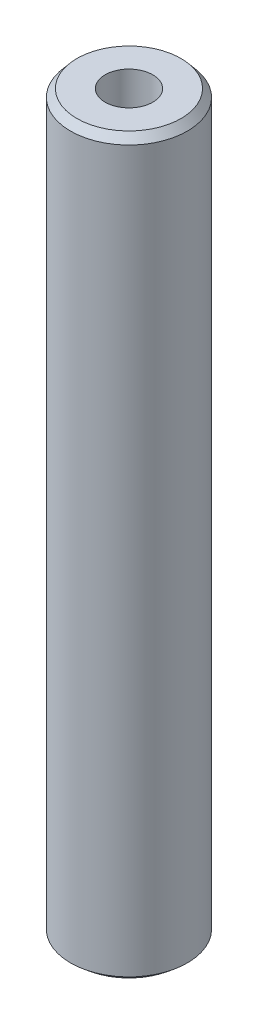
ISO-10303-21;
HEADER;
FILE_DESCRIPTION(('STEP AP214'),'2;1');
FILE_NAME('part.step','',(''),(''),'','','');
FILE_SCHEMA(('AUTOMOTIVE_DESIGN { 1 0 10303 214 1 1 1 1 }'));
ENDSEC;
DATA;
#1=APPLICATION_CONTEXT('core data for automotive mechanical design processes');
#2=APPLICATION_PROTOCOL_DEFINITION('international standard','automotive_design',2000,#1);
#3=PRODUCT_CONTEXT('',#1,'mechanical');
#4=PRODUCT('Part','Part','',(#3));
#5=PRODUCT_RELATED_PRODUCT_CATEGORY('part','',(#4));
#6=PRODUCT_DEFINITION_FORMATION('','',#4);
#7=PRODUCT_DEFINITION_CONTEXT('part definition',#1,'design');
#8=PRODUCT_DEFINITION('design','',#6,#7);
#9=PRODUCT_DEFINITION_SHAPE('','',#8);
#10=(LENGTH_UNIT() NAMED_UNIT(*) SI_UNIT(.MILLI.,.METRE.));
#11=(NAMED_UNIT(*) PLANE_ANGLE_UNIT() SI_UNIT($,.RADIAN.));
#12=(NAMED_UNIT(*) SI_UNIT($,.STERADIAN.) SOLID_ANGLE_UNIT());
#13=UNCERTAINTY_MEASURE_WITH_UNIT(LENGTH_MEASURE(1.E-05),#10,'distance_accuracy_value','');
#14=(GEOMETRIC_REPRESENTATION_CONTEXT(3) GLOBAL_UNCERTAINTY_ASSIGNED_CONTEXT((#13)) GLOBAL_UNIT_ASSIGNED_CONTEXT((#10,
#11,#12)) REPRESENTATION_CONTEXT('',''));
#15=CARTESIAN_POINT('',(0.,0.,0.));
#16=DIRECTION('',(0.,0.,1.));
#17=DIRECTION('',(1.,0.,0.));
#18=AXIS2_PLACEMENT_3D('',#15,#16,#17);
#19=CARTESIAN_POINT('',(0.,565.540317169403,0.));
#20=DIRECTION('',(0.,-1.,0.));
#21=DIRECTION('',(0.,0.,-1.));
#22=AXIS2_PLACEMENT_3D('',#19,#20,#21);
#23=CYLINDRICAL_SURFACE('',#22,45.);
#24=CARTESIAN_POINT('',(0.,559.626056848214,0.));
#25=DIRECTION('',(0.,1.,0.));
#26=DIRECTION('',(0.,0.,1.));
#27=AXIS2_PLACEMENT_3D('',#24,#25,#26);
#28=CIRCLE('',#27,45.);
#29=CARTESIAN_POINT('',(0.,559.626056848214,45.));
#30=VERTEX_POINT('',#29);
#31=EDGE_CURVE('E50',#30,#30,#28,.F.);
#32=ORIENTED_EDGE('',*,*,#31,.T.);
#33=EDGE_LOOP('',(#32));
#34=FACE_BOUND('',#33,.T.);
#35=CARTESIAN_POINT('',(0.,4.92343527548356,0.));
#36=DIRECTION('',(0.,1.,0.));
#37=DIRECTION('',(0.,0.,1.));
#38=AXIS2_PLACEMENT_3D('',#35,#36,#37);
#39=CIRCLE('',#38,45.);
#40=CARTESIAN_POINT('',(0.,4.92343527548356,45.));
#41=VERTEX_POINT('',#40);
#42=EDGE_CURVE('E51',#41,#41,#39,.T.);
#43=ORIENTED_EDGE('',*,*,#42,.T.);
#44=EDGE_LOOP('',(#43));
#45=FACE_BOUND('',#44,.T.);
#46=ADVANCED_FACE('F39',(#34,#45),#23,.T.);
#47=CARTESIAN_POINT('',(0.,565.540317169403,0.));
#48=DIRECTION('',(0.,1.,0.));
#49=DIRECTION('',(0.,0.,1.));
#50=AXIS2_PLACEMENT_3D('',#47,#48,#49);
#51=PLANE('',#50);
#52=CARTESIAN_POINT('',(0.,565.540317169403,0.));
#53=DIRECTION('',(0.,1.,0.));
#54=DIRECTION('',(0.,0.,1.));
#55=AXIS2_PLACEMENT_3D('',#52,#53,#54);
#56=CIRCLE('',#55,40.0765647245165);
#57=CARTESIAN_POINT('',(0.,565.540317169403,40.0765647245165));
#58=VERTEX_POINT('',#57);
#59=EDGE_CURVE('E54',#58,#58,#56,.T.);
#60=ORIENTED_EDGE('',*,*,#59,.T.);
#61=EDGE_LOOP('',(#60));
#62=FACE_BOUND('',#61,.T.);
#63=CARTESIAN_POINT('',(0.,565.540317169403,0.));
#64=DIRECTION('',(0.,1.,0.));
#65=DIRECTION('',(0.,0.,1.));
#66=AXIS2_PLACEMENT_3D('',#63,#64,#65);
#67=CIRCLE('',#66,18.3299555252651);
#68=CARTESIAN_POINT('',(0.,565.540317169403,18.3299555252651));
#69=VERTEX_POINT('',#68);
#70=EDGE_CURVE('E58',#69,#69,#67,.T.);
#71=ORIENTED_EDGE('',*,*,#70,.F.);
#72=EDGE_LOOP('',(#71));
#73=FACE_BOUND('',#72,.T.);
#74=ADVANCED_FACE('F69',(#62,#73),#51,.T.);
#75=CARTESIAN_POINT('',(0.,0.,0.));
#76=DIRECTION('',(0.,1.,0.));
#77=DIRECTION('',(0.,0.,1.));
#78=AXIS2_PLACEMENT_3D('',#75,#76,#77);
#79=PLANE('',#78);
#80=CARTESIAN_POINT('',(0.,0.,0.));
#81=DIRECTION('',(0.,1.,0.));
#82=DIRECTION('',(0.,0.,1.));
#83=AXIS2_PLACEMENT_3D('',#80,#81,#82);
#84=CIRCLE('',#83,39.0857396788108);
#85=CARTESIAN_POINT('',(0.,0.,39.0857396788108));
#86=VERTEX_POINT('',#85);
#87=EDGE_CURVE('E10',#86,#86,#84,.F.);
#88=ORIENTED_EDGE('',*,*,#87,.T.);
#89=EDGE_LOOP('',(#88));
#90=FACE_BOUND('',#89,.T.);
#91=CARTESIAN_POINT('',(0.,0.,0.));
#92=DIRECTION('',(0.,1.,0.));
#93=DIRECTION('',(0.,0.,1.));
#94=AXIS2_PLACEMENT_3D('',#91,#92,#93);
#95=CIRCLE('',#94,18.3299555252651);
#96=CARTESIAN_POINT('',(0.,0.,18.3299555252651));
#97=VERTEX_POINT('',#96);
#98=EDGE_CURVE('E63',#97,#97,#95,.T.);
#99=ORIENTED_EDGE('',*,*,#98,.T.);
#100=EDGE_LOOP('',(#99));
#101=FACE_BOUND('',#100,.T.);
#102=ADVANCED_FACE('F75',(#90,#101),#79,.F.);
#103=CARTESIAN_POINT('',(0.,565.540317169403,0.));
#104=DIRECTION('',(0.,-1.,0.));
#105=DIRECTION('',(0.,0.,-1.));
#106=AXIS2_PLACEMENT_3D('',#103,#104,#105);
#107=CYLINDRICAL_SURFACE('',#106,18.3299555252651);
#108=ORIENTED_EDGE('',*,*,#70,.T.);
#109=EDGE_LOOP('',(#108));
#110=FACE_BOUND('',#109,.T.);
#111=ORIENTED_EDGE('',*,*,#98,.F.);
#112=EDGE_LOOP('',(#111));
#113=FACE_BOUND('',#112,.T.);
#114=ADVANCED_FACE('F70',(#110,#113),#107,.F.);
#115=CARTESIAN_POINT('',(0.,565.540317169403,0.));
#116=DIRECTION('',(0.,-1.,0.));
#117=DIRECTION('',(0.,0.,-1.));
#118=AXIS2_PLACEMENT_3D('',#115,#116,#117);
#119=CONICAL_SURFACE('',#118,40.0765647245165,0.694227651369237);
#120=ORIENTED_EDGE('',*,*,#31,.F.);
#121=EDGE_LOOP('',(#120));
#122=FACE_BOUND('',#121,.T.);
#123=ORIENTED_EDGE('',*,*,#59,.F.);
#124=EDGE_LOOP('',(#123));
#125=FACE_BOUND('',#124,.T.);
#126=ADVANCED_FACE('F81',(#122,#125),#119,.T.);
#127=CARTESIAN_POINT('',(0.,4.92343527548356,0.));
#128=DIRECTION('',(0.,1.,0.));
#129=DIRECTION('',(0.,0.,1.));
#130=AXIS2_PLACEMENT_3D('',#127,#128,#129);
#131=CONICAL_SURFACE('',#130,45.,0.876568675425666);
#132=ORIENTED_EDGE('',*,*,#87,.F.);
#133=EDGE_LOOP('',(#132));
#134=FACE_BOUND('',#133,.T.);
#135=ORIENTED_EDGE('',*,*,#42,.F.);
#136=EDGE_LOOP('',(#135));
#137=FACE_BOUND('',#136,.T.);
#138=ADVANCED_FACE('F45',(#134,#137),#131,.T.);
#139=CLOSED_SHELL('',(#46,#74,#102,#114,#126,#138));
#140=MANIFOLD_SOLID_BREP('B2',#139);
#141=ADVANCED_BREP_SHAPE_REPRESENTATION('',(#18,#140),#14);
#142=SHAPE_DEFINITION_REPRESENTATION(#9,#141);
ENDSEC;
END-ISO-10303-21;
